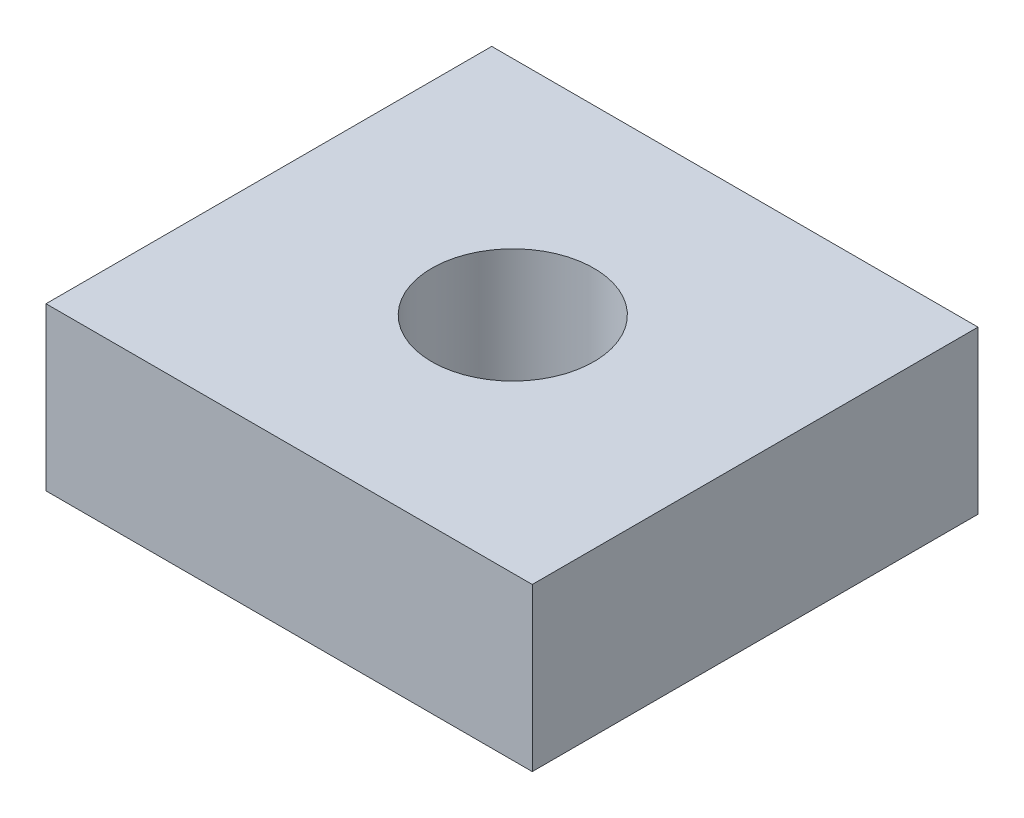
ISO-10303-21;
HEADER;
FILE_DESCRIPTION(('STEP AP214'),'2;1');
FILE_NAME('part.step','',(''),(''),'','','');
FILE_SCHEMA(('AUTOMOTIVE_DESIGN { 1 0 10303 214 1 1 1 1 }'));
ENDSEC;
DATA;
#1=APPLICATION_CONTEXT('core data for automotive mechanical design processes');
#2=APPLICATION_PROTOCOL_DEFINITION('international standard','automotive_design',2000,#1);
#3=PRODUCT_CONTEXT('',#1,'mechanical');
#4=PRODUCT('Part','Part','',(#3));
#5=PRODUCT_RELATED_PRODUCT_CATEGORY('part','',(#4));
#6=PRODUCT_DEFINITION_FORMATION('','',#4);
#7=PRODUCT_DEFINITION_CONTEXT('part definition',#1,'design');
#8=PRODUCT_DEFINITION('design','',#6,#7);
#9=PRODUCT_DEFINITION_SHAPE('','',#8);
#10=(LENGTH_UNIT() NAMED_UNIT(*) SI_UNIT(.MILLI.,.METRE.));
#11=(NAMED_UNIT(*) PLANE_ANGLE_UNIT() SI_UNIT($,.RADIAN.));
#12=(NAMED_UNIT(*) SI_UNIT($,.STERADIAN.) SOLID_ANGLE_UNIT());
#13=UNCERTAINTY_MEASURE_WITH_UNIT(LENGTH_MEASURE(1.E-05),#10,'distance_accuracy_value','');
#14=(GEOMETRIC_REPRESENTATION_CONTEXT(3) GLOBAL_UNCERTAINTY_ASSIGNED_CONTEXT((#13)) GLOBAL_UNIT_ASSIGNED_CONTEXT((#10,
#11,#12)) REPRESENTATION_CONTEXT('',''));
#15=CARTESIAN_POINT('',(0.,0.,0.));
#16=DIRECTION('',(0.,0.,1.));
#17=DIRECTION('',(1.,0.,0.));
#18=AXIS2_PLACEMENT_3D('',#15,#16,#17);
#19=CARTESIAN_POINT('',(0.,25.4,0.));
#20=DIRECTION('',(0.,-1.,0.));
#21=DIRECTION('',(0.,0.,-1.));
#22=AXIS2_PLACEMENT_3D('',#19,#20,#21);
#23=PLANE('',#22);
#24=DIRECTION('',(0.,0.,1.));
#25=VECTOR('',#24,1.);
#26=CARTESIAN_POINT('',(0.,25.4,0.));
#27=LINE('',#26,#25);
#28=CARTESIAN_POINT('',(0.,25.4,-69.85));
#29=VERTEX_POINT('',#28);
#30=CARTESIAN_POINT('',(0.,25.4,0.));
#31=VERTEX_POINT('',#30);
#32=EDGE_CURVE('E92',#29,#31,#27,.T.);
#33=ORIENTED_EDGE('',*,*,#32,.T.);
#34=DIRECTION('',(1.,0.,0.));
#35=VECTOR('',#34,1.);
#36=CARTESIAN_POINT('',(0.,25.4,0.));
#37=LINE('',#36,#35);
#38=CARTESIAN_POINT('',(76.2,25.4,0.));
#39=VERTEX_POINT('',#38);
#40=EDGE_CURVE('E87',#31,#39,#37,.T.);
#41=ORIENTED_EDGE('',*,*,#40,.T.);
#42=DIRECTION('',(0.,0.,-1.));
#43=VECTOR('',#42,1.);
#44=CARTESIAN_POINT('',(76.2,25.4,0.));
#45=LINE('',#44,#43);
#46=CARTESIAN_POINT('',(76.2,25.4,-69.85));
#47=VERTEX_POINT('',#46);
#48=EDGE_CURVE('E90',#39,#47,#45,.T.);
#49=ORIENTED_EDGE('',*,*,#48,.T.);
#50=DIRECTION('',(-1.,0.,0.));
#51=VECTOR('',#50,1.);
#52=CARTESIAN_POINT('',(0.,25.4,-69.85));
#53=LINE('',#52,#51);
#54=EDGE_CURVE('E57',#47,#29,#53,.T.);
#55=ORIENTED_EDGE('',*,*,#54,.T.);
#56=EDGE_LOOP('',(#33,#41,#49,#55));
#57=FACE_BOUND('',#56,.T.);
#58=CARTESIAN_POINT('',(38.1,25.4,-35.052));
#59=DIRECTION('',(0.,1.,0.));
#60=DIRECTION('',(0.,0.,1.));
#61=AXIS2_PLACEMENT_3D('',#58,#59,#60);
#62=CIRCLE('',#61,12.7);
#63=CARTESIAN_POINT('',(38.1,25.4,-22.352));
#64=VERTEX_POINT('',#63);
#65=EDGE_CURVE('E112',#64,#64,#62,.T.);
#66=ORIENTED_EDGE('',*,*,#65,.F.);
#67=EDGE_LOOP('',(#66));
#68=FACE_BOUND('',#67,.T.);
#69=ADVANCED_FACE('F39',(#57,#68),#23,.F.);
#70=CARTESIAN_POINT('',(0.,0.,0.));
#71=DIRECTION('',(0.,-1.,0.));
#72=DIRECTION('',(0.,0.,-1.));
#73=AXIS2_PLACEMENT_3D('',#70,#71,#72);
#74=PLANE('',#73);
#75=DIRECTION('',(0.,0.,1.));
#76=VECTOR('',#75,1.);
#77=CARTESIAN_POINT('',(0.,0.,0.));
#78=LINE('',#77,#76);
#79=CARTESIAN_POINT('',(0.,0.,-69.85));
#80=VERTEX_POINT('',#79);
#81=CARTESIAN_POINT('',(0.,0.,0.));
#82=VERTEX_POINT('',#81);
#83=EDGE_CURVE('E108',#80,#82,#78,.T.);
#84=ORIENTED_EDGE('',*,*,#83,.F.);
#85=DIRECTION('',(-1.,0.,0.));
#86=VECTOR('',#85,1.);
#87=CARTESIAN_POINT('',(0.,0.,-69.85));
#88=LINE('',#87,#86);
#89=CARTESIAN_POINT('',(76.2,0.,-69.85));
#90=VERTEX_POINT('',#89);
#91=EDGE_CURVE('E80',#90,#80,#88,.T.);
#92=ORIENTED_EDGE('',*,*,#91,.F.);
#93=DIRECTION('',(0.,0.,-1.));
#94=VECTOR('',#93,1.);
#95=CARTESIAN_POINT('',(76.2,0.,0.));
#96=LINE('',#95,#94);
#97=CARTESIAN_POINT('',(76.2,0.,0.));
#98=VERTEX_POINT('',#97);
#99=EDGE_CURVE('E74',#98,#90,#96,.T.);
#100=ORIENTED_EDGE('',*,*,#99,.F.);
#101=DIRECTION('',(1.,0.,0.));
#102=VECTOR('',#101,1.);
#103=CARTESIAN_POINT('',(0.,0.,0.));
#104=LINE('',#103,#102);
#105=EDGE_CURVE('E97',#82,#98,#104,.T.);
#106=ORIENTED_EDGE('',*,*,#105,.F.);
#107=EDGE_LOOP('',(#84,#92,#100,#106));
#108=FACE_BOUND('',#107,.T.);
#109=CARTESIAN_POINT('',(38.1,0.,-35.052));
#110=DIRECTION('',(0.,1.,0.));
#111=DIRECTION('',(0.,0.,1.));
#112=AXIS2_PLACEMENT_3D('',#109,#110,#111);
#113=CIRCLE('',#112,12.7);
#114=CARTESIAN_POINT('',(38.1,0.,-22.352));
#115=VERTEX_POINT('',#114);
#116=EDGE_CURVE('E130',#115,#115,#113,.T.);
#117=ORIENTED_EDGE('',*,*,#116,.T.);
#118=EDGE_LOOP('',(#117));
#119=FACE_BOUND('',#118,.T.);
#120=ADVANCED_FACE('F125',(#108,#119),#74,.T.);
#121=CARTESIAN_POINT('',(0.,25.4,0.));
#122=DIRECTION('',(1.,0.,0.));
#123=DIRECTION('',(0.,0.,-1.));
#124=AXIS2_PLACEMENT_3D('',#121,#122,#123);
#125=PLANE('',#124);
#126=ORIENTED_EDGE('',*,*,#83,.T.);
#127=DIRECTION('',(0.,-1.,0.));
#128=VECTOR('',#127,1.);
#129=CARTESIAN_POINT('',(0.,25.4,0.));
#130=LINE('',#129,#128);
#131=EDGE_CURVE('E11',#31,#82,#130,.T.);
#132=ORIENTED_EDGE('',*,*,#131,.F.);
#133=ORIENTED_EDGE('',*,*,#32,.F.);
#134=DIRECTION('',(0.,-1.,0.));
#135=VECTOR('',#134,1.);
#136=CARTESIAN_POINT('',(0.,25.4,-69.85));
#137=LINE('',#136,#135);
#138=EDGE_CURVE('E104',#29,#80,#137,.T.);
#139=ORIENTED_EDGE('',*,*,#138,.T.);
#140=EDGE_LOOP('',(#126,#132,#133,#139));
#141=FACE_BOUND('',#140,.T.);
#142=ADVANCED_FACE('F41',(#141),#125,.F.);
#143=CARTESIAN_POINT('',(0.,25.4,0.));
#144=DIRECTION('',(0.,0.,-1.));
#145=DIRECTION('',(-1.,0.,0.));
#146=AXIS2_PLACEMENT_3D('',#143,#144,#145);
#147=PLANE('',#146);
#148=ORIENTED_EDGE('',*,*,#105,.T.);
#149=DIRECTION('',(0.,-1.,0.));
#150=VECTOR('',#149,1.);
#151=CARTESIAN_POINT('',(76.2,25.4,0.));
#152=LINE('',#151,#150);
#153=EDGE_CURVE('E49',#39,#98,#152,.T.);
#154=ORIENTED_EDGE('',*,*,#153,.F.);
#155=ORIENTED_EDGE('',*,*,#40,.F.);
#156=ORIENTED_EDGE('',*,*,#131,.T.);
#157=EDGE_LOOP('',(#148,#154,#155,#156));
#158=FACE_BOUND('',#157,.T.);
#159=ADVANCED_FACE('F96',(#158),#147,.F.);
#160=CARTESIAN_POINT('',(76.2,25.4,0.));
#161=DIRECTION('',(-1.,0.,0.));
#162=DIRECTION('',(0.,0.,1.));
#163=AXIS2_PLACEMENT_3D('',#160,#161,#162);
#164=PLANE('',#163);
#165=ORIENTED_EDGE('',*,*,#99,.T.);
#166=DIRECTION('',(0.,-1.,0.));
#167=VECTOR('',#166,1.);
#168=CARTESIAN_POINT('',(76.2,25.4,-69.85));
#169=LINE('',#168,#167);
#170=EDGE_CURVE('E99',#47,#90,#169,.T.);
#171=ORIENTED_EDGE('',*,*,#170,.F.);
#172=ORIENTED_EDGE('',*,*,#48,.F.);
#173=ORIENTED_EDGE('',*,*,#153,.T.);
#174=EDGE_LOOP('',(#165,#171,#172,#173));
#175=FACE_BOUND('',#174,.T.);
#176=ADVANCED_FACE('F100',(#175),#164,.F.);
#177=CARTESIAN_POINT('',(0.,25.4,-69.85));
#178=DIRECTION('',(0.,0.,1.));
#179=DIRECTION('',(1.,0.,0.));
#180=AXIS2_PLACEMENT_3D('',#177,#178,#179);
#181=PLANE('',#180);
#182=ORIENTED_EDGE('',*,*,#91,.T.);
#183=ORIENTED_EDGE('',*,*,#138,.F.);
#184=ORIENTED_EDGE('',*,*,#54,.F.);
#185=ORIENTED_EDGE('',*,*,#170,.T.);
#186=EDGE_LOOP('',(#182,#183,#184,#185));
#187=FACE_BOUND('',#186,.T.);
#188=ADVANCED_FACE('F122',(#187),#181,.F.);
#189=CARTESIAN_POINT('',(38.1,25.4,-35.052));
#190=DIRECTION('',(0.,-1.,0.));
#191=DIRECTION('',(0.,0.,-1.));
#192=AXIS2_PLACEMENT_3D('',#189,#190,#191);
#193=CYLINDRICAL_SURFACE('',#192,12.7);
#194=ORIENTED_EDGE('',*,*,#65,.T.);
#195=EDGE_LOOP('',(#194));
#196=FACE_BOUND('',#195,.T.);
#197=ORIENTED_EDGE('',*,*,#116,.F.);
#198=EDGE_LOOP('',(#197));
#199=FACE_BOUND('',#198,.T.);
#200=ADVANCED_FACE('F138',(#196,#199),#193,.F.);
#201=CLOSED_SHELL('',(#69,#120,#142,#159,#176,#188,#200));
#202=MANIFOLD_SOLID_BREP('B2',#201);
#203=ADVANCED_BREP_SHAPE_REPRESENTATION('',(#18,#202),#14);
#204=SHAPE_DEFINITION_REPRESENTATION(#9,#203);
ENDSEC;
END-ISO-10303-21;
